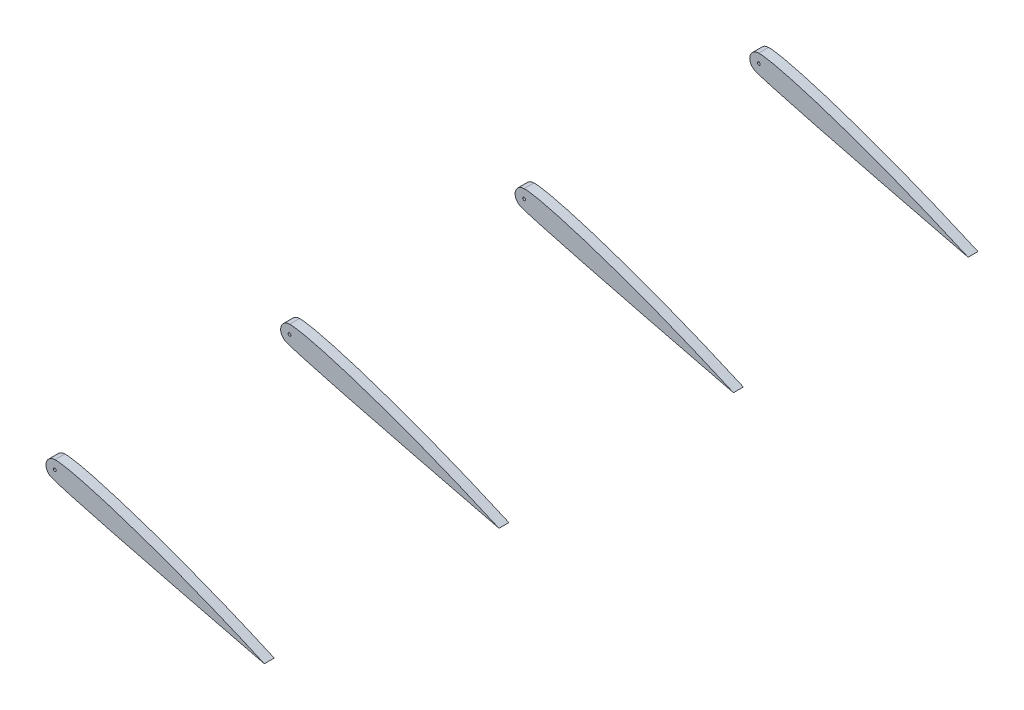
ISO-10303-21;
HEADER;
FILE_DESCRIPTION(('STEP AP214'),'2;1');
FILE_NAME('part.step','',(''),(''),'','','');
FILE_SCHEMA(('AUTOMOTIVE_DESIGN { 1 0 10303 214 1 1 1 1 }'));
ENDSEC;
DATA;
#1=APPLICATION_CONTEXT('core data for automotive mechanical design processes');
#2=APPLICATION_PROTOCOL_DEFINITION('international standard','automotive_design',2000,#1);
#3=PRODUCT_CONTEXT('',#1,'mechanical');
#4=PRODUCT('Part','Part','',(#3));
#5=PRODUCT_RELATED_PRODUCT_CATEGORY('part','',(#4));
#6=PRODUCT_DEFINITION_FORMATION('','',#4);
#7=PRODUCT_DEFINITION_CONTEXT('part definition',#1,'design');
#8=PRODUCT_DEFINITION('design','',#6,#7);
#9=PRODUCT_DEFINITION_SHAPE('','',#8);
#10=(LENGTH_UNIT() NAMED_UNIT(*) SI_UNIT(.MILLI.,.METRE.));
#11=(NAMED_UNIT(*) PLANE_ANGLE_UNIT() SI_UNIT($,.RADIAN.));
#12=(NAMED_UNIT(*) SI_UNIT($,.STERADIAN.) SOLID_ANGLE_UNIT());
#13=UNCERTAINTY_MEASURE_WITH_UNIT(LENGTH_MEASURE(1.E-05),#10,'distance_accuracy_value','');
#14=(GEOMETRIC_REPRESENTATION_CONTEXT(3) GLOBAL_UNCERTAINTY_ASSIGNED_CONTEXT((#13)) GLOBAL_UNIT_ASSIGNED_CONTEXT((#10,
#11,#12)) REPRESENTATION_CONTEXT('',''));
#15=CARTESIAN_POINT('',(0.,0.,0.));
#16=DIRECTION('',(0.,0.,1.));
#17=DIRECTION('',(1.,0.,0.));
#18=AXIS2_PLACEMENT_3D('',#15,#16,#17);
#19=CARTESIAN_POINT('',(33.0378614143754,-11.015920008617,-210.360006));
#20=CARTESIAN_POINT('',(0.567022571763437,3.42040196911013,-210.360006));
#21=CARTESIAN_POINT('',(-26.1759591858701,11.2297483273255,-210.360006));
#22=CARTESIAN_POINT('',(-30.4605089517355,10.8117715014901,-210.360006));
#23=B_SPLINE_CURVE_WITH_KNOTS('',3,(#19,#20,#21,#22),.UNSPECIFIED.,.F.,.F.,(4,4),(0.,1.),.UNSPECIFIED.);
#24=DIRECTION('',(0.,0.,-1.));
#25=VECTOR('',#24,1.);
#26=SURFACE_OF_LINEAR_EXTRUSION('',#23,#25);
#27=CARTESIAN_POINT('',(33.0378614143754,-11.015920008617,-213.36));
#28=CARTESIAN_POINT('',(0.567022571763437,3.42040196911013,-213.36));
#29=CARTESIAN_POINT('',(-26.1759591858701,11.2297483273255,-213.36));
#30=CARTESIAN_POINT('',(-30.4605089517355,10.8117715014901,-213.36));
#31=B_SPLINE_CURVE_WITH_KNOTS('',3,(#27,#28,#29,#30),.UNSPECIFIED.,.F.,.F.,(4,4),(0.,1.),.UNSPECIFIED.);
#32=CARTESIAN_POINT('',(33.0378614143754,-11.015920008617,-213.36));
#33=VERTEX_POINT('',#32);
#34=CARTESIAN_POINT('',(-30.4605089517355,10.8117715014901,-213.36));
#35=VERTEX_POINT('',#34);
#36=EDGE_CURVE('E91',#33,#35,#31,.T.);
#37=ORIENTED_EDGE('',*,*,#36,.T.);
#38=DIRECTION('',(0.,0.,-1.));
#39=VECTOR('',#38,1.);
#40=CARTESIAN_POINT('',(-30.4605089517355,10.8117715014901,-210.360006));
#41=LINE('',#40,#39);
#42=CARTESIAN_POINT('',(-30.4605089517355,10.8117715014901,-210.360006));
#43=VERTEX_POINT('',#42);
#44=EDGE_CURVE('E12',#43,#35,#41,.T.);
#45=ORIENTED_EDGE('',*,*,#44,.F.);
#46=CARTESIAN_POINT('',(33.0378614143754,-11.015920008617,-210.360006));
#47=VERTEX_POINT('',#46);
#48=EDGE_CURVE('E85',#47,#43,#23,.T.);
#49=ORIENTED_EDGE('',*,*,#48,.F.);
#50=DIRECTION('',(0.,0.,-1.));
#51=VECTOR('',#50,1.);
#52=CARTESIAN_POINT('',(33.0378614143754,-11.015920008617,-210.360006));
#53=LINE('',#52,#51);
#54=EDGE_CURVE('E92',#47,#33,#53,.T.);
#55=ORIENTED_EDGE('',*,*,#54,.T.);
#56=EDGE_LOOP('',(#37,#45,#49,#55));
#57=FACE_BOUND('',#56,.T.);
#58=ADVANCED_FACE('F44',(#57),#26,.F.);
#59=CARTESIAN_POINT('',(-30.4605089517355,8.12244803688346,-210.360006));
#60=DIRECTION('',(0.,0.,-1.));
#61=DIRECTION('',(-1.,0.,0.));
#62=AXIS2_PLACEMENT_3D('',#59,#60,#61);
#63=CYLINDRICAL_SURFACE('',#62,2.68932346460666);
#64=CARTESIAN_POINT('',(-30.4605089517355,8.12244803688346,-213.36));
#65=DIRECTION('',(0.,0.,1.));
#66=DIRECTION('',(1.,0.,0.));
#67=AXIS2_PLACEMENT_3D('',#64,#65,#66);
#68=CIRCLE('',#67,2.68932346460666);
#69=CARTESIAN_POINT('',(-31.895086499465,5.84770674239864,-213.36));
#70=VERTEX_POINT('',#69);
#71=EDGE_CURVE('E73',#35,#70,#68,.T.);
#72=ORIENTED_EDGE('',*,*,#71,.T.);
#73=DIRECTION('',(0.,0.,-1.));
#74=VECTOR('',#73,1.);
#75=CARTESIAN_POINT('',(-31.895086499465,5.84770674239864,-210.360006));
#76=LINE('',#75,#74);
#77=CARTESIAN_POINT('',(-31.895086499465,5.84770674239864,-210.360006));
#78=VERTEX_POINT('',#77);
#79=EDGE_CURVE('E53',#78,#70,#76,.T.);
#80=ORIENTED_EDGE('',*,*,#79,.F.);
#81=CARTESIAN_POINT('',(-30.4605089517355,8.12244803688346,-210.360006));
#82=DIRECTION('',(0.,0.,1.));
#83=DIRECTION('',(1.,0.,0.));
#84=AXIS2_PLACEMENT_3D('',#81,#82,#83);
#85=CIRCLE('',#84,2.68932346460666);
#86=EDGE_CURVE('E81',#43,#78,#85,.T.);
#87=ORIENTED_EDGE('',*,*,#86,.F.);
#88=ORIENTED_EDGE('',*,*,#44,.T.);
#89=EDGE_LOOP('',(#72,#80,#87,#88));
#90=FACE_BOUND('',#89,.T.);
#91=ADVANCED_FACE('F82',(#90),#63,.T.);
#92=CARTESIAN_POINT('',(-31.895086499465,5.84770674239865,-210.360006));
#93=CARTESIAN_POINT('',(-29.6878508249632,4.26990552198849,-210.360006));
#94=CARTESIAN_POINT('',(33.0378614143754,-11.015920008617,-210.360006));
#95=B_SPLINE_CURVE_WITH_KNOTS('',2,(#92,#93,#94),.UNSPECIFIED.,.F.,.F.,(3,3),(0.,1.),.UNSPECIFIED.);
#96=DIRECTION('',(0.,0.,-1.));
#97=VECTOR('',#96,1.);
#98=SURFACE_OF_LINEAR_EXTRUSION('',#95,#97);
#99=CARTESIAN_POINT('',(-31.895086499465,5.84770674239865,-213.36));
#100=CARTESIAN_POINT('',(-29.6878508249632,4.26990552198849,-213.36));
#101=CARTESIAN_POINT('',(33.0378614143754,-11.015920008617,-213.36));
#102=B_SPLINE_CURVE_WITH_KNOTS('',2,(#99,#100,#101),.UNSPECIFIED.,.F.,.F.,(3,3),(0.,1.),.UNSPECIFIED.);
#103=EDGE_CURVE('E78',#70,#33,#102,.T.);
#104=ORIENTED_EDGE('',*,*,#103,.T.);
#105=ORIENTED_EDGE('',*,*,#54,.F.);
#106=EDGE_CURVE('E61',#78,#47,#95,.T.);
#107=ORIENTED_EDGE('',*,*,#106,.F.);
#108=ORIENTED_EDGE('',*,*,#79,.T.);
#109=EDGE_LOOP('',(#104,#105,#107,#108));
#110=FACE_BOUND('',#109,.T.);
#111=ADVANCED_FACE('F116',(#110),#98,.F.);
#112=CARTESIAN_POINT('',(-9.28118217246002,5.46828779777251,-210.360006));
#113=DIRECTION('',(0.,0.,1.));
#114=DIRECTION('',(1.,0.,0.));
#115=AXIS2_PLACEMENT_3D('',#112,#113,#114);
#116=PLANE('',#115);
#117=CARTESIAN_POINT('',(-30.4045234507522,8.12002808398807,-210.360006));
#118=DIRECTION('',(0.,0.,1.));
#119=DIRECTION('',(1.,0.,0.));
#120=AXIS2_PLACEMENT_3D('',#117,#118,#119);
#121=CIRCLE('',#120,0.432278283515269);
#122=CARTESIAN_POINT('',(-29.9722451672369,8.12002808398807,-210.360006));
#123=VERTEX_POINT('',#122);
#124=EDGE_CURVE('E94',#123,#123,#121,.T.);
#125=ORIENTED_EDGE('',*,*,#124,.F.);
#126=EDGE_LOOP('',(#125));
#127=FACE_BOUND('',#126,.T.);
#128=ORIENTED_EDGE('',*,*,#48,.T.);
#129=ORIENTED_EDGE('',*,*,#86,.T.);
#130=ORIENTED_EDGE('',*,*,#106,.T.);
#131=EDGE_LOOP('',(#128,#129,#130));
#132=FACE_BOUND('',#131,.T.);
#133=ADVANCED_FACE('F88',(#127,#132),#116,.T.);
#134=CARTESIAN_POINT('',(-9.28118217246002,5.46828779777251,-213.36));
#135=DIRECTION('',(0.,0.,1.));
#136=DIRECTION('',(1.,0.,0.));
#137=AXIS2_PLACEMENT_3D('',#134,#135,#136);
#138=PLANE('',#137);
#139=CARTESIAN_POINT('',(-30.4045234507522,8.12002808398807,-213.36));
#140=DIRECTION('',(0.,0.,1.));
#141=DIRECTION('',(1.,0.,0.));
#142=AXIS2_PLACEMENT_3D('',#139,#140,#141);
#143=CIRCLE('',#142,0.432278283515269);
#144=CARTESIAN_POINT('',(-29.9722451672369,8.12002808398807,-213.36));
#145=VERTEX_POINT('',#144);
#146=EDGE_CURVE('E98',#145,#145,#143,.T.);
#147=ORIENTED_EDGE('',*,*,#146,.T.);
#148=EDGE_LOOP('',(#147));
#149=FACE_BOUND('',#148,.T.);
#150=ORIENTED_EDGE('',*,*,#36,.F.);
#151=ORIENTED_EDGE('',*,*,#103,.F.);
#152=ORIENTED_EDGE('',*,*,#71,.F.);
#153=EDGE_LOOP('',(#150,#151,#152));
#154=FACE_BOUND('',#153,.T.);
#155=ADVANCED_FACE('F117',(#149,#154),#138,.F.);
#156=CARTESIAN_POINT('',(-30.4045234507522,8.12002808398807,-213.36));
#157=DIRECTION('',(0.,0.,1.));
#158=DIRECTION('',(1.,0.,0.));
#159=AXIS2_PLACEMENT_3D('',#156,#157,#158);
#160=CYLINDRICAL_SURFACE('',#159,0.432278283515269);
#161=ORIENTED_EDGE('',*,*,#124,.T.);
#162=EDGE_LOOP('',(#161));
#163=FACE_BOUND('',#162,.T.);
#164=ORIENTED_EDGE('',*,*,#146,.F.);
#165=EDGE_LOOP('',(#164));
#166=FACE_BOUND('',#165,.T.);
#167=ADVANCED_FACE('F119',(#163,#166),#160,.F.);
#168=CLOSED_SHELL('',(#58,#91,#111,#133,#155,#167));
#169=MANIFOLD_SOLID_BREP('B2',#168);
#170=CARTESIAN_POINT('',(33.0378614143754,-11.015920008617,-139.240006));
#171=CARTESIAN_POINT('',(0.567022571763435,3.42040196911013,-139.240006));
#172=CARTESIAN_POINT('',(-26.1759591858701,11.2297483273255,-139.240006));
#173=CARTESIAN_POINT('',(-30.4605089517355,10.8117715014901,-139.240006));
#174=B_SPLINE_CURVE_WITH_KNOTS('',3,(#170,#171,#172,#173),.UNSPECIFIED.,.F.,.F.,(4,4),(0.,1.),.UNSPECIFIED.);
#175=DIRECTION('',(0.,0.,-1.));
#176=VECTOR('',#175,1.);
#177=SURFACE_OF_LINEAR_EXTRUSION('',#174,#176);
#178=CARTESIAN_POINT('',(33.0378614143754,-11.015920008617,-142.24));
#179=CARTESIAN_POINT('',(0.567022571763435,3.42040196911013,-142.24));
#180=CARTESIAN_POINT('',(-26.1759591858701,11.2297483273255,-142.24));
#181=CARTESIAN_POINT('',(-30.4605089517355,10.8117715014901,-142.24));
#182=B_SPLINE_CURVE_WITH_KNOTS('',3,(#178,#179,#180,#181),.UNSPECIFIED.,.F.,.F.,(4,4),(0.,1.),.UNSPECIFIED.);
#183=CARTESIAN_POINT('',(33.0378614143754,-11.015920008617,-142.24));
#184=VERTEX_POINT('',#183);
#185=CARTESIAN_POINT('',(-30.4605089517355,10.8117715014901,-142.24));
#186=VERTEX_POINT('',#185);
#187=EDGE_CURVE('E243',#184,#186,#182,.T.);
#188=ORIENTED_EDGE('',*,*,#187,.T.);
#189=DIRECTION('',(0.,0.,-1.));
#190=VECTOR('',#189,1.);
#191=CARTESIAN_POINT('',(-30.4605089517355,10.8117715014901,-139.240006));
#192=LINE('',#191,#190);
#193=CARTESIAN_POINT('',(-30.4605089517355,10.8117715014901,-139.240006));
#194=VERTEX_POINT('',#193);
#195=EDGE_CURVE('E42',#194,#186,#192,.T.);
#196=ORIENTED_EDGE('',*,*,#195,.F.);
#197=CARTESIAN_POINT('',(33.0378614143754,-11.015920008617,-139.240006));
#198=VERTEX_POINT('',#197);
#199=EDGE_CURVE('E237',#198,#194,#174,.T.);
#200=ORIENTED_EDGE('',*,*,#199,.F.);
#201=DIRECTION('',(0.,0.,-1.));
#202=VECTOR('',#201,1.);
#203=CARTESIAN_POINT('',(33.0378614143754,-11.015920008617,-139.240006));
#204=LINE('',#203,#202);
#205=EDGE_CURVE('E244',#198,#184,#204,.T.);
#206=ORIENTED_EDGE('',*,*,#205,.T.);
#207=EDGE_LOOP('',(#188,#196,#200,#206));
#208=FACE_BOUND('',#207,.T.);
#209=ADVANCED_FACE('F195',(#208),#177,.F.);
#210=CARTESIAN_POINT('',(-30.4605089517355,8.12244803688346,-139.240006));
#211=DIRECTION('',(0.,0.,-1.));
#212=DIRECTION('',(-1.,0.,0.));
#213=AXIS2_PLACEMENT_3D('',#210,#211,#212);
#214=CYLINDRICAL_SURFACE('',#213,2.68932346460666);
#215=CARTESIAN_POINT('',(-30.4605089517355,8.12244803688346,-142.24));
#216=DIRECTION('',(0.,0.,1.));
#217=DIRECTION('',(1.,0.,0.));
#218=AXIS2_PLACEMENT_3D('',#215,#216,#217);
#219=CIRCLE('',#218,2.68932346460666);
#220=CARTESIAN_POINT('',(-31.895086499465,5.84770674239864,-142.24));
#221=VERTEX_POINT('',#220);
#222=EDGE_CURVE('E225',#186,#221,#219,.T.);
#223=ORIENTED_EDGE('',*,*,#222,.T.);
#224=DIRECTION('',(0.,0.,-1.));
#225=VECTOR('',#224,1.);
#226=CARTESIAN_POINT('',(-31.895086499465,5.84770674239864,-139.240006));
#227=LINE('',#226,#225);
#228=CARTESIAN_POINT('',(-31.895086499465,5.84770674239864,-139.240006));
#229=VERTEX_POINT('',#228);
#230=EDGE_CURVE('E205',#229,#221,#227,.T.);
#231=ORIENTED_EDGE('',*,*,#230,.F.);
#232=CARTESIAN_POINT('',(-30.4605089517355,8.12244803688346,-139.240006));
#233=DIRECTION('',(0.,0.,1.));
#234=DIRECTION('',(1.,0.,0.));
#235=AXIS2_PLACEMENT_3D('',#232,#233,#234);
#236=CIRCLE('',#235,2.68932346460666);
#237=EDGE_CURVE('E233',#194,#229,#236,.T.);
#238=ORIENTED_EDGE('',*,*,#237,.F.);
#239=ORIENTED_EDGE('',*,*,#195,.T.);
#240=EDGE_LOOP('',(#223,#231,#238,#239));
#241=FACE_BOUND('',#240,.T.);
#242=ADVANCED_FACE('F234',(#241),#214,.T.);
#243=CARTESIAN_POINT('',(-31.895086499465,5.84770674239865,-139.240006));
#244=CARTESIAN_POINT('',(-29.6878508249632,4.26990552198849,-139.240006));
#245=CARTESIAN_POINT('',(33.0378614143754,-11.015920008617,-139.240006));
#246=B_SPLINE_CURVE_WITH_KNOTS('',2,(#243,#244,#245),.UNSPECIFIED.,.F.,.F.,(3,3),(0.,1.),.UNSPECIFIED.);
#247=DIRECTION('',(0.,0.,-1.));
#248=VECTOR('',#247,1.);
#249=SURFACE_OF_LINEAR_EXTRUSION('',#246,#248);
#250=CARTESIAN_POINT('',(-31.895086499465,5.84770674239865,-142.24));
#251=CARTESIAN_POINT('',(-29.6878508249632,4.26990552198849,-142.24));
#252=CARTESIAN_POINT('',(33.0378614143754,-11.015920008617,-142.24));
#253=B_SPLINE_CURVE_WITH_KNOTS('',2,(#250,#251,#252),.UNSPECIFIED.,.F.,.F.,(3,3),(0.,1.),.UNSPECIFIED.);
#254=EDGE_CURVE('E230',#221,#184,#253,.T.);
#255=ORIENTED_EDGE('',*,*,#254,.T.);
#256=ORIENTED_EDGE('',*,*,#205,.F.);
#257=EDGE_CURVE('E213',#229,#198,#246,.T.);
#258=ORIENTED_EDGE('',*,*,#257,.F.);
#259=ORIENTED_EDGE('',*,*,#230,.T.);
#260=EDGE_LOOP('',(#255,#256,#258,#259));
#261=FACE_BOUND('',#260,.T.);
#262=ADVANCED_FACE('F268',(#261),#249,.F.);
#263=CARTESIAN_POINT('',(-9.28118217246002,5.46828779777251,-139.240006));
#264=DIRECTION('',(0.,0.,1.));
#265=DIRECTION('',(1.,0.,0.));
#266=AXIS2_PLACEMENT_3D('',#263,#264,#265);
#267=PLANE('',#266);
#268=CARTESIAN_POINT('',(-30.4045234507522,8.12002808398807,-139.240006));
#269=DIRECTION('',(0.,0.,1.));
#270=DIRECTION('',(1.,0.,0.));
#271=AXIS2_PLACEMENT_3D('',#268,#269,#270);
#272=CIRCLE('',#271,0.432278283515269);
#273=CARTESIAN_POINT('',(-29.9722451672369,8.12002808398807,-139.240006));
#274=VERTEX_POINT('',#273);
#275=EDGE_CURVE('E246',#274,#274,#272,.T.);
#276=ORIENTED_EDGE('',*,*,#275,.F.);
#277=EDGE_LOOP('',(#276));
#278=FACE_BOUND('',#277,.T.);
#279=ORIENTED_EDGE('',*,*,#199,.T.);
#280=ORIENTED_EDGE('',*,*,#237,.T.);
#281=ORIENTED_EDGE('',*,*,#257,.T.);
#282=EDGE_LOOP('',(#279,#280,#281));
#283=FACE_BOUND('',#282,.T.);
#284=ADVANCED_FACE('F240',(#278,#283),#267,.T.);
#285=CARTESIAN_POINT('',(-9.28118217246002,5.46828779777251,-142.24));
#286=DIRECTION('',(0.,0.,1.));
#287=DIRECTION('',(1.,0.,0.));
#288=AXIS2_PLACEMENT_3D('',#285,#286,#287);
#289=PLANE('',#288);
#290=CARTESIAN_POINT('',(-30.4045234507522,8.12002808398807,-142.24));
#291=DIRECTION('',(0.,0.,1.));
#292=DIRECTION('',(1.,0.,0.));
#293=AXIS2_PLACEMENT_3D('',#290,#291,#292);
#294=CIRCLE('',#293,0.432278283515269);
#295=CARTESIAN_POINT('',(-29.9722451672369,8.12002808398807,-142.24));
#296=VERTEX_POINT('',#295);
#297=EDGE_CURVE('E199',#296,#296,#294,.T.);
#298=ORIENTED_EDGE('',*,*,#297,.T.);
#299=EDGE_LOOP('',(#298));
#300=FACE_BOUND('',#299,.T.);
#301=ORIENTED_EDGE('',*,*,#187,.F.);
#302=ORIENTED_EDGE('',*,*,#254,.F.);
#303=ORIENTED_EDGE('',*,*,#222,.F.);
#304=EDGE_LOOP('',(#301,#302,#303));
#305=FACE_BOUND('',#304,.T.);
#306=ADVANCED_FACE('F269',(#300,#305),#289,.F.);
#307=CARTESIAN_POINT('',(-30.4045234507522,8.12002808398807,-213.36));
#308=DIRECTION('',(0.,0.,1.));
#309=DIRECTION('',(1.,0.,0.));
#310=AXIS2_PLACEMENT_3D('',#307,#308,#309);
#311=CYLINDRICAL_SURFACE('',#310,0.432278283515269);
#312=ORIENTED_EDGE('',*,*,#275,.T.);
#313=EDGE_LOOP('',(#312));
#314=FACE_BOUND('',#313,.T.);
#315=ORIENTED_EDGE('',*,*,#297,.F.);
#316=EDGE_LOOP('',(#315));
#317=FACE_BOUND('',#316,.T.);
#318=ADVANCED_FACE('F271',(#314,#317),#311,.F.);
#319=CLOSED_SHELL('',(#209,#242,#262,#284,#306,#318));
#320=MANIFOLD_SOLID_BREP('B6',#319);
#321=CARTESIAN_POINT('',(33.0938469153588,-11.0183399615124,-68.120006));
#322=CARTESIAN_POINT('',(0.623008072746796,3.41798201621474,-68.120006));
#323=CARTESIAN_POINT('',(-26.1199736848868,11.2273283744301,-68.120006));
#324=CARTESIAN_POINT('',(-30.4045234507522,10.8093515485947,-68.120006));
#325=B_SPLINE_CURVE_WITH_KNOTS('',3,(#321,#322,#323,#324),.UNSPECIFIED.,.F.,.F.,(4,4),(0.,1.),.UNSPECIFIED.);
#326=DIRECTION('',(0.,0.,-1.));
#327=VECTOR('',#326,1.);
#328=SURFACE_OF_LINEAR_EXTRUSION('',#325,#327);
#329=CARTESIAN_POINT('',(33.0938469153588,-11.0183399615124,-71.12));
#330=CARTESIAN_POINT('',(0.623008072746796,3.41798201621474,-71.12));
#331=CARTESIAN_POINT('',(-26.1199736848868,11.2273283744301,-71.12));
#332=CARTESIAN_POINT('',(-30.4045234507522,10.8093515485947,-71.12));
#333=B_SPLINE_CURVE_WITH_KNOTS('',3,(#329,#330,#331,#332),.UNSPECIFIED.,.F.,.F.,(4,4),(0.,1.),.UNSPECIFIED.);
#334=CARTESIAN_POINT('',(33.0938469153587,-11.0183399615124,-71.12));
#335=VERTEX_POINT('',#334);
#336=CARTESIAN_POINT('',(-30.4045234507522,10.8093515485947,-71.12));
#337=VERTEX_POINT('',#336);
#338=EDGE_CURVE('E393',#335,#337,#333,.T.);
#339=ORIENTED_EDGE('',*,*,#338,.T.);
#340=DIRECTION('',(0.,0.,-1.));
#341=VECTOR('',#340,1.);
#342=CARTESIAN_POINT('',(-30.4045234507522,10.8093515485947,-68.120006));
#343=LINE('',#342,#341);
#344=CARTESIAN_POINT('',(-30.4045234507522,10.8093515485947,-68.120006));
#345=VERTEX_POINT('',#344);
#346=EDGE_CURVE('E193',#345,#337,#343,.T.);
#347=ORIENTED_EDGE('',*,*,#346,.F.);
#348=CARTESIAN_POINT('',(33.0938469153587,-11.0183399615124,-68.120006));
#349=VERTEX_POINT('',#348);
#350=EDGE_CURVE('E387',#349,#345,#325,.T.);
#351=ORIENTED_EDGE('',*,*,#350,.F.);
#352=DIRECTION('',(0.,0.,-1.));
#353=VECTOR('',#352,1.);
#354=CARTESIAN_POINT('',(33.0938469153587,-11.0183399615124,-68.120006));
#355=LINE('',#354,#353);
#356=EDGE_CURVE('E394',#349,#335,#355,.T.);
#357=ORIENTED_EDGE('',*,*,#356,.T.);
#358=EDGE_LOOP('',(#339,#347,#351,#357));
#359=FACE_BOUND('',#358,.T.);
#360=ADVANCED_FACE('F345',(#359),#328,.F.);
#361=CARTESIAN_POINT('',(-30.4045234507522,8.12002808398807,-68.120006));
#362=DIRECTION('',(0.,0.,-1.));
#363=DIRECTION('',(-1.,0.,0.));
#364=AXIS2_PLACEMENT_3D('',#361,#362,#363);
#365=CYLINDRICAL_SURFACE('',#364,2.68932346460666);
#366=CARTESIAN_POINT('',(-30.4045234507522,8.12002808398807,-71.12));
#367=DIRECTION('',(0.,0.,1.));
#368=DIRECTION('',(1.,0.,0.));
#369=AXIS2_PLACEMENT_3D('',#366,#367,#368);
#370=CIRCLE('',#369,2.68932346460666);
#371=CARTESIAN_POINT('',(-31.8391009984816,5.84528678950325,-71.12));
#372=VERTEX_POINT('',#371);
#373=EDGE_CURVE('E375',#337,#372,#370,.T.);
#374=ORIENTED_EDGE('',*,*,#373,.T.);
#375=DIRECTION('',(0.,0.,-1.));
#376=VECTOR('',#375,1.);
#377=CARTESIAN_POINT('',(-31.8391009984816,5.84528678950325,-68.120006));
#378=LINE('',#377,#376);
#379=CARTESIAN_POINT('',(-31.8391009984816,5.84528678950325,-68.120006));
#380=VERTEX_POINT('',#379);
#381=EDGE_CURVE('E355',#380,#372,#378,.T.);
#382=ORIENTED_EDGE('',*,*,#381,.F.);
#383=CARTESIAN_POINT('',(-30.4045234507522,8.12002808398807,-68.120006));
#384=DIRECTION('',(0.,0.,1.));
#385=DIRECTION('',(1.,0.,0.));
#386=AXIS2_PLACEMENT_3D('',#383,#384,#385);
#387=CIRCLE('',#386,2.68932346460666);
#388=EDGE_CURVE('E383',#345,#380,#387,.T.);
#389=ORIENTED_EDGE('',*,*,#388,.F.);
#390=ORIENTED_EDGE('',*,*,#346,.T.);
#391=EDGE_LOOP('',(#374,#382,#389,#390));
#392=FACE_BOUND('',#391,.T.);
#393=ADVANCED_FACE('F384',(#392),#365,.T.);
#394=CARTESIAN_POINT('',(-31.8391009984816,5.84528678950326,-68.120006));
#395=CARTESIAN_POINT('',(-29.6318653239798,4.2674855690931,-68.120006));
#396=CARTESIAN_POINT('',(33.0938469153587,-11.0183399615124,-68.120006));
#397=B_SPLINE_CURVE_WITH_KNOTS('',2,(#394,#395,#396),.UNSPECIFIED.,.F.,.F.,(3,3),(0.,1.),.UNSPECIFIED.);
#398=DIRECTION('',(0.,0.,-1.));
#399=VECTOR('',#398,1.);
#400=SURFACE_OF_LINEAR_EXTRUSION('',#397,#399);
#401=CARTESIAN_POINT('',(-31.8391009984816,5.84528678950326,-71.12));
#402=CARTESIAN_POINT('',(-29.6318653239798,4.2674855690931,-71.12));
#403=CARTESIAN_POINT('',(33.0938469153587,-11.0183399615124,-71.12));
#404=B_SPLINE_CURVE_WITH_KNOTS('',2,(#401,#402,#403),.UNSPECIFIED.,.F.,.F.,(3,3),(0.,1.),.UNSPECIFIED.);
#405=EDGE_CURVE('E380',#372,#335,#404,.T.);
#406=ORIENTED_EDGE('',*,*,#405,.T.);
#407=ORIENTED_EDGE('',*,*,#356,.F.);
#408=EDGE_CURVE('E363',#380,#349,#397,.T.);
#409=ORIENTED_EDGE('',*,*,#408,.F.);
#410=ORIENTED_EDGE('',*,*,#381,.T.);
#411=EDGE_LOOP('',(#406,#407,#409,#410));
#412=FACE_BOUND('',#411,.T.);
#413=ADVANCED_FACE('F418',(#412),#400,.F.);
#414=CARTESIAN_POINT('',(-9.22519667147666,5.46586784487711,-68.120006));
#415=DIRECTION('',(0.,0.,1.));
#416=DIRECTION('',(1.,0.,0.));
#417=AXIS2_PLACEMENT_3D('',#414,#415,#416);
#418=PLANE('',#417);
#419=CARTESIAN_POINT('',(-30.4045234507522,8.12002808398807,-68.120006));
#420=DIRECTION('',(0.,0.,1.));
#421=DIRECTION('',(1.,0.,0.));
#422=AXIS2_PLACEMENT_3D('',#419,#420,#421);
#423=CIRCLE('',#422,0.432278283515269);
#424=CARTESIAN_POINT('',(-29.9722451672369,8.12002808398807,-68.120006));
#425=VERTEX_POINT('',#424);
#426=EDGE_CURVE('E396',#425,#425,#423,.T.);
#427=ORIENTED_EDGE('',*,*,#426,.F.);
#428=EDGE_LOOP('',(#427));
#429=FACE_BOUND('',#428,.T.);
#430=ORIENTED_EDGE('',*,*,#350,.T.);
#431=ORIENTED_EDGE('',*,*,#388,.T.);
#432=ORIENTED_EDGE('',*,*,#408,.T.);
#433=EDGE_LOOP('',(#430,#431,#432));
#434=FACE_BOUND('',#433,.T.);
#435=ADVANCED_FACE('F390',(#429,#434),#418,.T.);
#436=CARTESIAN_POINT('',(-9.22519667147666,5.46586784487711,-71.12));
#437=DIRECTION('',(0.,0.,1.));
#438=DIRECTION('',(1.,0.,0.));
#439=AXIS2_PLACEMENT_3D('',#436,#437,#438);
#440=PLANE('',#439);
#441=CARTESIAN_POINT('',(-30.4045234507522,8.12002808398807,-71.12));
#442=DIRECTION('',(0.,0.,1.));
#443=DIRECTION('',(1.,0.,0.));
#444=AXIS2_PLACEMENT_3D('',#441,#442,#443);
#445=CIRCLE('',#444,0.432278283515269);
#446=CARTESIAN_POINT('',(-29.9722451672369,8.12002808398807,-71.12));
#447=VERTEX_POINT('',#446);
#448=EDGE_CURVE('E349',#447,#447,#445,.T.);
#449=ORIENTED_EDGE('',*,*,#448,.T.);
#450=EDGE_LOOP('',(#449));
#451=FACE_BOUND('',#450,.T.);
#452=ORIENTED_EDGE('',*,*,#338,.F.);
#453=ORIENTED_EDGE('',*,*,#405,.F.);
#454=ORIENTED_EDGE('',*,*,#373,.F.);
#455=EDGE_LOOP('',(#452,#453,#454));
#456=FACE_BOUND('',#455,.T.);
#457=ADVANCED_FACE('F419',(#451,#456),#440,.F.);
#458=CARTESIAN_POINT('',(-30.4045234507522,8.12002808398807,-213.36));
#459=DIRECTION('',(0.,0.,1.));
#460=DIRECTION('',(1.,0.,0.));
#461=AXIS2_PLACEMENT_3D('',#458,#459,#460);
#462=CYLINDRICAL_SURFACE('',#461,0.432278283515269);
#463=ORIENTED_EDGE('',*,*,#426,.T.);
#464=EDGE_LOOP('',(#463));
#465=FACE_BOUND('',#464,.T.);
#466=ORIENTED_EDGE('',*,*,#448,.F.);
#467=EDGE_LOOP('',(#466));
#468=FACE_BOUND('',#467,.T.);
#469=ADVANCED_FACE('F421',(#465,#468),#462,.F.);
#470=CLOSED_SHELL('',(#360,#393,#413,#435,#457,#469));
#471=MANIFOLD_SOLID_BREP('B36',#470);
#472=CARTESIAN_POINT('',(-30.4045234507522,8.12002808398807,2.999994));
#473=DIRECTION('',(0.,0.,-1.));
#474=DIRECTION('',(-1.,0.,0.));
#475=AXIS2_PLACEMENT_3D('',#472,#473,#474);
#476=CYLINDRICAL_SURFACE('',#475,2.68932346460666);
#477=CARTESIAN_POINT('',(-30.4045234507522,8.12002808398807,0.));
#478=DIRECTION('',(0.,0.,1.));
#479=DIRECTION('',(1.,0.,0.));
#480=AXIS2_PLACEMENT_3D('',#477,#478,#479);
#481=CIRCLE('',#480,2.68932346460666);
#482=CARTESIAN_POINT('',(-30.4045234507522,10.8093515485947,0.));
#483=VERTEX_POINT('',#482);
#484=CARTESIAN_POINT('',(-31.8391009984816,5.84528678950326,0.));
#485=VERTEX_POINT('',#484);
#486=EDGE_CURVE('E533',#483,#485,#481,.T.);
#487=ORIENTED_EDGE('',*,*,#486,.T.);
#488=DIRECTION('',(0.,0.,-1.));
#489=VECTOR('',#488,1.);
#490=CARTESIAN_POINT('',(-31.8391009984816,5.84528678950326,2.999994));
#491=LINE('',#490,#489);
#492=CARTESIAN_POINT('',(-31.8391009984816,5.84528678950326,2.999994));
#493=VERTEX_POINT('',#492);
#494=EDGE_CURVE('E343',#493,#485,#491,.T.);
#495=ORIENTED_EDGE('',*,*,#494,.F.);
#496=CARTESIAN_POINT('',(-30.4045234507522,8.12002808398807,2.999994));
#497=DIRECTION('',(0.,0.,1.));
#498=DIRECTION('',(1.,0.,0.));
#499=AXIS2_PLACEMENT_3D('',#496,#497,#498);
#500=CIRCLE('',#499,2.68932346460666);
#501=CARTESIAN_POINT('',(-30.4045234507522,10.8093515485947,2.999994));
#502=VERTEX_POINT('',#501);
#503=EDGE_CURVE('E528',#502,#493,#500,.T.);
#504=ORIENTED_EDGE('',*,*,#503,.F.);
#505=DIRECTION('',(0.,0.,-1.));
#506=VECTOR('',#505,1.);
#507=CARTESIAN_POINT('',(-30.4045234507522,10.8093515485947,2.999994));
#508=LINE('',#507,#506);
#509=EDGE_CURVE('E503',#502,#483,#508,.T.);
#510=ORIENTED_EDGE('',*,*,#509,.T.);
#511=EDGE_LOOP('',(#487,#495,#504,#510));
#512=FACE_BOUND('',#511,.T.);
#513=ADVANCED_FACE('F486',(#512),#476,.T.);
#514=CARTESIAN_POINT('',(-31.8391009984816,5.84528678950326,2.999994));
#515=CARTESIAN_POINT('',(-29.6318653239798,4.2674855690931,2.999994));
#516=CARTESIAN_POINT('',(33.0938469153587,-11.0183399615124,2.999994));
#517=B_SPLINE_CURVE_WITH_KNOTS('',2,(#514,#515,#516),.UNSPECIFIED.,.F.,.F.,(3,3),(0.,1.),.UNSPECIFIED.);
#518=DIRECTION('',(0.,0.,-1.));
#519=VECTOR('',#518,1.);
#520=SURFACE_OF_LINEAR_EXTRUSION('',#517,#519);
#521=CARTESIAN_POINT('',(-31.8391009984816,5.84528678950326,0.));
#522=CARTESIAN_POINT('',(-29.6318653239798,4.2674855690931,0.));
#523=CARTESIAN_POINT('',(33.0938469153587,-11.0183399615124,0.));
#524=B_SPLINE_CURVE_WITH_KNOTS('',2,(#521,#522,#523),.UNSPECIFIED.,.F.,.F.,(3,3),(0.,1.),.UNSPECIFIED.);
#525=CARTESIAN_POINT('',(33.0938469153588,-11.0183399615124,0.));
#526=VERTEX_POINT('',#525);
#527=EDGE_CURVE('E536',#485,#526,#524,.T.);
#528=ORIENTED_EDGE('',*,*,#527,.T.);
#529=DIRECTION('',(0.,0.,-1.));
#530=VECTOR('',#529,1.);
#531=CARTESIAN_POINT('',(33.0938469153588,-11.0183399615124,2.999994));
#532=LINE('',#531,#530);
#533=CARTESIAN_POINT('',(33.0938469153588,-11.0183399615124,2.999994));
#534=VERTEX_POINT('',#533);
#535=EDGE_CURVE('E495',#534,#526,#532,.T.);
#536=ORIENTED_EDGE('',*,*,#535,.F.);
#537=EDGE_CURVE('E521',#493,#534,#517,.T.);
#538=ORIENTED_EDGE('',*,*,#537,.F.);
#539=ORIENTED_EDGE('',*,*,#494,.T.);
#540=EDGE_LOOP('',(#528,#536,#538,#539));
#541=FACE_BOUND('',#540,.T.);
#542=ADVANCED_FACE('F523',(#541),#520,.F.);
#543=CARTESIAN_POINT('',(-30.4045234507522,10.8093515485947,2.999994));
#544=CARTESIAN_POINT('',(-26.1199736848868,11.2273283744301,2.999994));
#545=CARTESIAN_POINT('',(0.623008072746796,3.41798201621474,2.999994));
#546=CARTESIAN_POINT('',(33.0938469153588,-11.0183399615124,2.999994));
#547=B_SPLINE_CURVE_WITH_KNOTS('',3,(#543,#544,#545,#546),.UNSPECIFIED.,.F.,.F.,(4,4),(0.,1.),.UNSPECIFIED.);
#548=DIRECTION('',(0.,0.,-1.));
#549=VECTOR('',#548,1.);
#550=SURFACE_OF_LINEAR_EXTRUSION('',#547,#549);
#551=CARTESIAN_POINT('',(-30.4045234507522,10.8093515485947,0.));
#552=CARTESIAN_POINT('',(-26.1199736848868,11.2273283744301,0.));
#553=CARTESIAN_POINT('',(0.623008072746796,3.41798201621474,0.));
#554=CARTESIAN_POINT('',(33.0938469153588,-11.0183399615124,0.));
#555=B_SPLINE_CURVE_WITH_KNOTS('',3,(#551,#552,#553,#554),.UNSPECIFIED.,.F.,.F.,(4,4),(0.,1.),.UNSPECIFIED.);
#556=EDGE_CURVE('E531',#483,#526,#555,.T.);
#557=ORIENTED_EDGE('',*,*,#556,.F.);
#558=ORIENTED_EDGE('',*,*,#509,.F.);
#559=EDGE_CURVE('E527',#502,#534,#547,.T.);
#560=ORIENTED_EDGE('',*,*,#559,.T.);
#561=ORIENTED_EDGE('',*,*,#535,.T.);
#562=EDGE_LOOP('',(#557,#558,#560,#561));
#563=FACE_BOUND('',#562,.T.);
#564=ADVANCED_FACE('F558',(#563),#550,.T.);
#565=CARTESIAN_POINT('',(-30.4045234507522,8.12002808398807,2.999994));
#566=DIRECTION('',(0.,0.,1.));
#567=DIRECTION('',(1.,0.,0.));
#568=AXIS2_PLACEMENT_3D('',#565,#566,#567);
#569=PLANE('',#568);
#570=CARTESIAN_POINT('',(-30.4045234507522,8.12002808398807,2.999994));
#571=DIRECTION('',(0.,0.,1.));
#572=DIRECTION('',(1.,0.,0.));
#573=AXIS2_PLACEMENT_3D('',#570,#571,#572);
#574=CIRCLE('',#573,0.432278283515269);
#575=CARTESIAN_POINT('',(-29.9722451672369,8.12002808398807,2.999994));
#576=VERTEX_POINT('',#575);
#577=EDGE_CURVE('E540',#576,#576,#574,.T.);
#578=ORIENTED_EDGE('',*,*,#577,.F.);
#579=EDGE_LOOP('',(#578));
#580=FACE_BOUND('',#579,.T.);
#581=ORIENTED_EDGE('',*,*,#503,.T.);
#582=ORIENTED_EDGE('',*,*,#537,.T.);
#583=ORIENTED_EDGE('',*,*,#559,.F.);
#584=EDGE_LOOP('',(#581,#582,#583));
#585=FACE_BOUND('',#584,.T.);
#586=ADVANCED_FACE('F530',(#580,#585),#569,.T.);
#587=CARTESIAN_POINT('',(-30.4045234507522,8.12002808398807,0.));
#588=DIRECTION('',(0.,0.,1.));
#589=DIRECTION('',(1.,0.,0.));
#590=AXIS2_PLACEMENT_3D('',#587,#588,#589);
#591=PLANE('',#590);
#592=CARTESIAN_POINT('',(-30.4045234507522,8.12002808398807,0.));
#593=DIRECTION('',(0.,0.,1.));
#594=DIRECTION('',(1.,0.,0.));
#595=AXIS2_PLACEMENT_3D('',#592,#593,#594);
#596=CIRCLE('',#595,0.432278283515269);
#597=CARTESIAN_POINT('',(-29.9722451672369,8.12002808398807,0.));
#598=VERTEX_POINT('',#597);
#599=EDGE_CURVE('E489',#598,#598,#596,.T.);
#600=ORIENTED_EDGE('',*,*,#599,.T.);
#601=EDGE_LOOP('',(#600));
#602=FACE_BOUND('',#601,.T.);
#603=ORIENTED_EDGE('',*,*,#486,.F.);
#604=ORIENTED_EDGE('',*,*,#556,.T.);
#605=ORIENTED_EDGE('',*,*,#527,.F.);
#606=EDGE_LOOP('',(#603,#604,#605));
#607=FACE_BOUND('',#606,.T.);
#608=ADVANCED_FACE('F566',(#602,#607),#591,.F.);
#609=CARTESIAN_POINT('',(-30.4045234507522,8.12002808398807,-213.36));
#610=DIRECTION('',(0.,0.,1.));
#611=DIRECTION('',(1.,0.,0.));
#612=AXIS2_PLACEMENT_3D('',#609,#610,#611);
#613=CYLINDRICAL_SURFACE('',#612,0.432278283515269);
#614=ORIENTED_EDGE('',*,*,#577,.T.);
#615=EDGE_LOOP('',(#614));
#616=FACE_BOUND('',#615,.T.);
#617=ORIENTED_EDGE('',*,*,#599,.F.);
#618=EDGE_LOOP('',(#617));
#619=FACE_BOUND('',#618,.T.);
#620=ADVANCED_FACE('F592',(#616,#619),#613,.F.);
#621=CLOSED_SHELL('',(#513,#542,#564,#586,#608,#620));
#622=MANIFOLD_SOLID_BREP('B187',#621);
#623=ADVANCED_BREP_SHAPE_REPRESENTATION('',(#18,#169,#320,#471,#622),#14);
#624=SHAPE_DEFINITION_REPRESENTATION(#9,#623);
ENDSEC;
END-ISO-10303-21;
